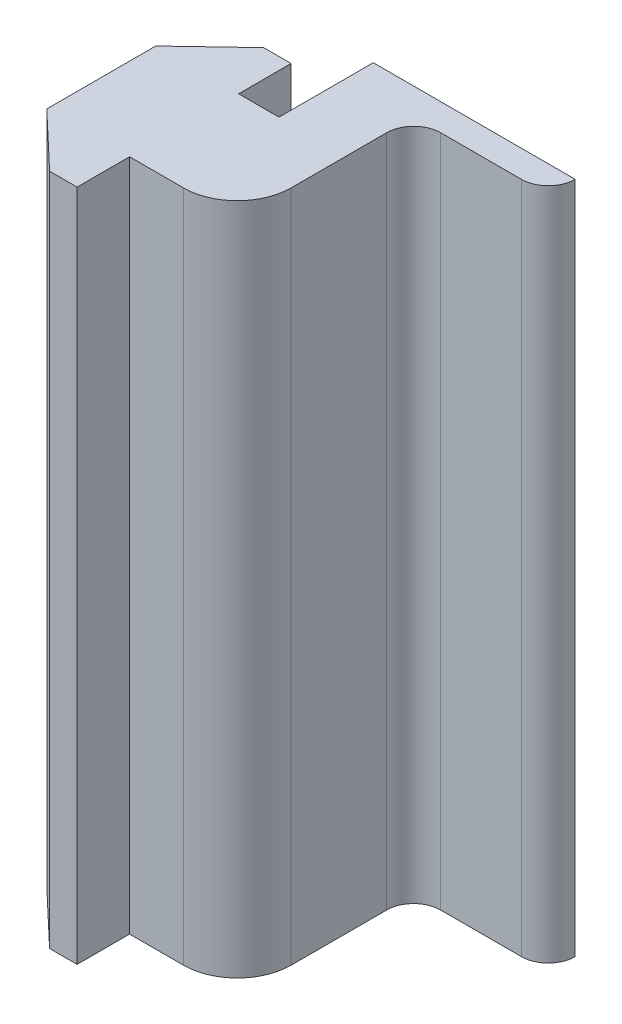
ISO-10303-21;
HEADER;
FILE_DESCRIPTION(('STEP AP214'),'2;1');
FILE_NAME('part.step','',(''),(''),'','','');
FILE_SCHEMA(('AUTOMOTIVE_DESIGN { 1 0 10303 214 1 1 1 1 }'));
ENDSEC;
DATA;
#1=APPLICATION_CONTEXT('core data for automotive mechanical design processes');
#2=APPLICATION_PROTOCOL_DEFINITION('international standard','automotive_design',2000,#1);
#3=PRODUCT_CONTEXT('',#1,'mechanical');
#4=PRODUCT('Part','Part','',(#3));
#5=PRODUCT_RELATED_PRODUCT_CATEGORY('part','',(#4));
#6=PRODUCT_DEFINITION_FORMATION('','',#4);
#7=PRODUCT_DEFINITION_CONTEXT('part definition',#1,'design');
#8=PRODUCT_DEFINITION('design','',#6,#7);
#9=PRODUCT_DEFINITION_SHAPE('','',#8);
#10=(LENGTH_UNIT() NAMED_UNIT(*) SI_UNIT(.MILLI.,.METRE.));
#11=(NAMED_UNIT(*) PLANE_ANGLE_UNIT() SI_UNIT($,.RADIAN.));
#12=(NAMED_UNIT(*) SI_UNIT($,.STERADIAN.) SOLID_ANGLE_UNIT());
#13=UNCERTAINTY_MEASURE_WITH_UNIT(LENGTH_MEASURE(1.E-05),#10,'distance_accuracy_value','');
#14=(GEOMETRIC_REPRESENTATION_CONTEXT(3) GLOBAL_UNCERTAINTY_ASSIGNED_CONTEXT((#13)) GLOBAL_UNIT_ASSIGNED_CONTEXT((#10,
#11,#12)) REPRESENTATION_CONTEXT('',''));
#15=CARTESIAN_POINT('',(0.,0.,0.));
#16=DIRECTION('',(0.,0.,1.));
#17=DIRECTION('',(1.,0.,0.));
#18=AXIS2_PLACEMENT_3D('',#15,#16,#17);
#19=CARTESIAN_POINT('',(0.,50.,-4.05));
#20=DIRECTION('',(0.,0.,-1.));
#21=DIRECTION('',(-1.,0.,0.));
#22=AXIS2_PLACEMENT_3D('',#19,#20,#21);
#23=PLANE('',#22);
#24=DIRECTION('',(1.,0.,0.));
#25=VECTOR('',#24,1.);
#26=CARTESIAN_POINT('',(0.,0.,-4.05));
#27=LINE('',#26,#25);
#28=CARTESIAN_POINT('',(0.,0.,-4.05));
#29=VERTEX_POINT('',#28);
#30=CARTESIAN_POINT('',(2.99999999999996,0.,-4.05));
#31=VERTEX_POINT('',#30);
#32=EDGE_CURVE('E160',#29,#31,#27,.T.);
#33=ORIENTED_EDGE('',*,*,#32,.F.);
#34=DIRECTION('',(0.,-1.,0.));
#35=VECTOR('',#34,1.);
#36=CARTESIAN_POINT('',(0.,50.,-4.05));
#37=LINE('',#36,#35);
#38=CARTESIAN_POINT('',(0.,50.,-4.05));
#39=VERTEX_POINT('',#38);
#40=EDGE_CURVE('E156',#39,#29,#37,.T.);
#41=ORIENTED_EDGE('',*,*,#40,.F.);
#42=DIRECTION('',(1.,0.,0.));
#43=VECTOR('',#42,1.);
#44=CARTESIAN_POINT('',(0.,50.,-4.05));
#45=LINE('',#44,#43);
#46=CARTESIAN_POINT('',(2.99999999999996,50.,-4.05));
#47=VERTEX_POINT('',#46);
#48=EDGE_CURVE('E158',#39,#47,#45,.T.);
#49=ORIENTED_EDGE('',*,*,#48,.T.);
#50=DIRECTION('',(0.,-1.,0.));
#51=VECTOR('',#50,1.);
#52=CARTESIAN_POINT('',(2.99999999999996,50.,-4.05));
#53=LINE('',#52,#51);
#54=EDGE_CURVE('E221',#47,#31,#53,.T.);
#55=ORIENTED_EDGE('',*,*,#54,.T.);
#56=EDGE_LOOP('',(#33,#41,#49,#55));
#57=FACE_BOUND('',#56,.T.);
#58=ADVANCED_FACE('F44',(#57),#23,.T.);
#59=CARTESIAN_POINT('',(0.,50.,0.));
#60=DIRECTION('',(1.,0.,0.));
#61=DIRECTION('',(0.,0.,-1.));
#62=AXIS2_PLACEMENT_3D('',#59,#60,#61);
#63=PLANE('',#62);
#64=DIRECTION('',(0.,0.,1.));
#65=VECTOR('',#64,1.);
#66=CARTESIAN_POINT('',(0.,0.,0.));
#67=LINE('',#66,#65);
#68=CARTESIAN_POINT('',(0.,0.,-7.95));
#69=VERTEX_POINT('',#68);
#70=EDGE_CURVE('E224',#69,#29,#67,.T.);
#71=ORIENTED_EDGE('',*,*,#70,.F.);
#72=DIRECTION('',(0.,-1.,0.));
#73=VECTOR('',#72,1.);
#74=CARTESIAN_POINT('',(0.,50.,-7.95));
#75=LINE('',#74,#73);
#76=CARTESIAN_POINT('',(0.,50.,-7.95));
#77=VERTEX_POINT('',#76);
#78=EDGE_CURVE('E167',#77,#69,#75,.T.);
#79=ORIENTED_EDGE('',*,*,#78,.F.);
#80=DIRECTION('',(0.,0.,1.));
#81=VECTOR('',#80,1.);
#82=CARTESIAN_POINT('',(0.,50.,0.));
#83=LINE('',#82,#81);
#84=EDGE_CURVE('E173',#77,#39,#83,.T.);
#85=ORIENTED_EDGE('',*,*,#84,.T.);
#86=ORIENTED_EDGE('',*,*,#40,.T.);
#87=EDGE_LOOP('',(#71,#79,#85,#86));
#88=FACE_BOUND('',#87,.T.);
#89=ADVANCED_FACE('F181',(#88),#63,.T.);
#90=CARTESIAN_POINT('',(0.,50.,-7.95));
#91=DIRECTION('',(0.,0.,-1.));
#92=DIRECTION('',(-1.,0.,0.));
#93=AXIS2_PLACEMENT_3D('',#90,#91,#92);
#94=PLANE('',#93);
#95=DIRECTION('',(1.,0.,0.));
#96=VECTOR('',#95,1.);
#97=CARTESIAN_POINT('',(0.,0.,-7.95));
#98=LINE('',#97,#96);
#99=CARTESIAN_POINT('',(-2.04000000000008,0.,-7.94999999999998));
#100=VERTEX_POINT('',#99);
#101=EDGE_CURVE('E227',#100,#69,#98,.T.);
#102=ORIENTED_EDGE('',*,*,#101,.F.);
#103=DIRECTION('',(0.,-1.,0.));
#104=VECTOR('',#103,1.);
#105=CARTESIAN_POINT('',(-2.04000000000008,50.,-7.94999999999998));
#106=LINE('',#105,#104);
#107=CARTESIAN_POINT('',(-2.04000000000008,50.,-7.94999999999998));
#108=VERTEX_POINT('',#107);
#109=EDGE_CURVE('E289',#108,#100,#106,.T.);
#110=ORIENTED_EDGE('',*,*,#109,.F.);
#111=DIRECTION('',(1.,0.,0.));
#112=VECTOR('',#111,1.);
#113=CARTESIAN_POINT('',(0.,50.,-7.95));
#114=LINE('',#113,#112);
#115=EDGE_CURVE('E183',#108,#77,#114,.T.);
#116=ORIENTED_EDGE('',*,*,#115,.T.);
#117=ORIENTED_EDGE('',*,*,#78,.T.);
#118=EDGE_LOOP('',(#102,#110,#116,#117));
#119=FACE_BOUND('',#118,.T.);
#120=ADVANCED_FACE('F362',(#119),#94,.T.);
#121=CARTESIAN_POINT('',(-4.93600140143802,50.,-5.20217481392659));
#122=DIRECTION('',(-0.688304815664146,0.,-0.725421588273706));
#123=DIRECTION('',(-0.725421588273706,0.,0.688304815664146));
#124=AXIS2_PLACEMENT_3D('',#121,#122,#123);
#125=PLANE('',#124);
#126=DIRECTION('',(0.725421588273706,0.,-0.688304815664146));
#127=VECTOR('',#126,1.);
#128=CARTESIAN_POINT('',(-4.93600140143802,0.,-5.20217481392659));
#129=LINE('',#128,#127);
#130=CARTESIAN_POINT('',(-6.15241498392372,0.,-4.04799999999993));
#131=VERTEX_POINT('',#130);
#132=EDGE_CURVE('E232',#131,#100,#129,.T.);
#133=ORIENTED_EDGE('',*,*,#132,.F.);
#134=DIRECTION('',(0.,-1.,0.));
#135=VECTOR('',#134,1.);
#136=CARTESIAN_POINT('',(-6.15241498392372,50.,-4.04799999999993));
#137=LINE('',#136,#135);
#138=CARTESIAN_POINT('',(-6.15241498392372,50.,-4.04799999999993));
#139=VERTEX_POINT('',#138);
#140=EDGE_CURVE('E286',#139,#131,#137,.T.);
#141=ORIENTED_EDGE('',*,*,#140,.F.);
#142=DIRECTION('',(0.725421588273706,0.,-0.688304815664146));
#143=VECTOR('',#142,1.);
#144=CARTESIAN_POINT('',(-4.93600140143802,50.,-5.20217481392659));
#145=LINE('',#144,#143);
#146=EDGE_CURVE('E187',#139,#108,#145,.T.);
#147=ORIENTED_EDGE('',*,*,#146,.T.);
#148=ORIENTED_EDGE('',*,*,#109,.T.);
#149=EDGE_LOOP('',(#133,#141,#147,#148));
#150=FACE_BOUND('',#149,.T.);
#151=ADVANCED_FACE('F358',(#150),#125,.T.);
#152=CARTESIAN_POINT('',(-6.15241498392368,50.,0.));
#153=DIRECTION('',(-1.,0.,0.));
#154=DIRECTION('',(0.,0.,1.));
#155=AXIS2_PLACEMENT_3D('',#152,#153,#154);
#156=PLANE('',#155);
#157=DIRECTION('',(0.,0.,-1.));
#158=VECTOR('',#157,1.);
#159=CARTESIAN_POINT('',(-6.15241498392368,0.,0.));
#160=LINE('',#159,#158);
#161=CARTESIAN_POINT('',(-6.15241498392364,0.,4.04800000000007));
#162=VERTEX_POINT('',#161);
#163=EDGE_CURVE('E236',#162,#131,#160,.T.);
#164=ORIENTED_EDGE('',*,*,#163,.F.);
#165=DIRECTION('',(0.,-1.,0.));
#166=VECTOR('',#165,1.);
#167=CARTESIAN_POINT('',(-6.15241498392364,50.,4.04800000000007));
#168=LINE('',#167,#166);
#169=CARTESIAN_POINT('',(-6.15241498392364,50.,4.04800000000007));
#170=VERTEX_POINT('',#169);
#171=EDGE_CURVE('E283',#170,#162,#168,.T.);
#172=ORIENTED_EDGE('',*,*,#171,.F.);
#173=DIRECTION('',(0.,0.,-1.));
#174=VECTOR('',#173,1.);
#175=CARTESIAN_POINT('',(-6.15241498392368,50.,0.));
#176=LINE('',#175,#174);
#177=EDGE_CURVE('E207',#170,#139,#176,.T.);
#178=ORIENTED_EDGE('',*,*,#177,.T.);
#179=ORIENTED_EDGE('',*,*,#140,.T.);
#180=EDGE_LOOP('',(#164,#172,#178,#179));
#181=FACE_BOUND('',#180,.T.);
#182=ADVANCED_FACE('F354',(#181),#156,.T.);
#183=CARTESIAN_POINT('',(-4.93600140143791,50.,5.2021748139267));
#184=DIRECTION('',(-0.68830481566413,0.,0.725421588273721));
#185=DIRECTION('',(0.725421588273721,0.,0.68830481566413));
#186=AXIS2_PLACEMENT_3D('',#183,#184,#185);
#187=PLANE('',#186);
#188=DIRECTION('',(-0.725421588273721,0.,-0.68830481566413));
#189=VECTOR('',#188,1.);
#190=CARTESIAN_POINT('',(-4.93600140143791,0.,5.2021748139267));
#191=LINE('',#190,#189);
#192=CARTESIAN_POINT('',(-2.03999999999991,0.,7.95000000000002));
#193=VERTEX_POINT('',#192);
#194=EDGE_CURVE('E240',#193,#162,#191,.T.);
#195=ORIENTED_EDGE('',*,*,#194,.F.);
#196=DIRECTION('',(0.,-1.,0.));
#197=VECTOR('',#196,1.);
#198=CARTESIAN_POINT('',(-2.03999999999991,50.,7.95000000000002));
#199=LINE('',#198,#197);
#200=CARTESIAN_POINT('',(-2.03999999999991,50.,7.95000000000002));
#201=VERTEX_POINT('',#200);
#202=EDGE_CURVE('E280',#201,#193,#199,.T.);
#203=ORIENTED_EDGE('',*,*,#202,.F.);
#204=DIRECTION('',(-0.725421588273721,0.,-0.68830481566413));
#205=VECTOR('',#204,1.);
#206=CARTESIAN_POINT('',(-4.93600140143791,50.,5.2021748139267));
#207=LINE('',#206,#205);
#208=EDGE_CURVE('E201',#201,#170,#207,.T.);
#209=ORIENTED_EDGE('',*,*,#208,.T.);
#210=ORIENTED_EDGE('',*,*,#171,.T.);
#211=EDGE_LOOP('',(#195,#203,#209,#210));
#212=FACE_BOUND('',#211,.T.);
#213=ADVANCED_FACE('F349',(#212),#187,.T.);
#214=CARTESIAN_POINT('',(0.,50.,7.95));
#215=DIRECTION('',(0.,0.,1.));
#216=DIRECTION('',(1.,0.,0.));
#217=AXIS2_PLACEMENT_3D('',#214,#215,#216);
#218=PLANE('',#217);
#219=DIRECTION('',(-1.,0.,0.));
#220=VECTOR('',#219,1.);
#221=CARTESIAN_POINT('',(0.,0.,7.95));
#222=LINE('',#221,#220);
#223=CARTESIAN_POINT('',(0.,0.,7.95));
#224=VERTEX_POINT('',#223);
#225=EDGE_CURVE('E244',#224,#193,#222,.T.);
#226=ORIENTED_EDGE('',*,*,#225,.F.);
#227=DIRECTION('',(0.,-1.,0.));
#228=VECTOR('',#227,1.);
#229=CARTESIAN_POINT('',(0.,50.,7.95));
#230=LINE('',#229,#228);
#231=CARTESIAN_POINT('',(0.,50.,7.95));
#232=VERTEX_POINT('',#231);
#233=EDGE_CURVE('E277',#232,#224,#230,.T.);
#234=ORIENTED_EDGE('',*,*,#233,.F.);
#235=DIRECTION('',(-1.,0.,0.));
#236=VECTOR('',#235,1.);
#237=CARTESIAN_POINT('',(0.,50.,7.95));
#238=LINE('',#237,#236);
#239=EDGE_CURVE('E192',#232,#201,#238,.T.);
#240=ORIENTED_EDGE('',*,*,#239,.T.);
#241=ORIENTED_EDGE('',*,*,#202,.T.);
#242=EDGE_LOOP('',(#226,#234,#240,#241));
#243=FACE_BOUND('',#242,.T.);
#244=ADVANCED_FACE('F346',(#243),#218,.T.);
#245=CARTESIAN_POINT('',(0.,0.,4.05));
#246=VERTEX_POINT('',#245);
#247=EDGE_CURVE('E228',#246,#224,#67,.T.);
#248=ORIENTED_EDGE('',*,*,#247,.F.);
#249=DIRECTION('',(0.,-1.,0.));
#250=VECTOR('',#249,1.);
#251=CARTESIAN_POINT('',(0.,50.,4.05));
#252=LINE('',#251,#250);
#253=CARTESIAN_POINT('',(0.,50.,4.05));
#254=VERTEX_POINT('',#253);
#255=EDGE_CURVE('E274',#254,#246,#252,.T.);
#256=ORIENTED_EDGE('',*,*,#255,.F.);
#257=EDGE_CURVE('E185',#254,#232,#83,.T.);
#258=ORIENTED_EDGE('',*,*,#257,.T.);
#259=ORIENTED_EDGE('',*,*,#233,.T.);
#260=EDGE_LOOP('',(#248,#256,#258,#259));
#261=FACE_BOUND('',#260,.T.);
#262=ADVANCED_FACE('F342',(#261),#63,.T.);
#263=CARTESIAN_POINT('',(0.,50.,4.05));
#264=DIRECTION('',(0.,0.,-1.));
#265=DIRECTION('',(-1.,0.,0.));
#266=AXIS2_PLACEMENT_3D('',#263,#264,#265);
#267=PLANE('',#266);
#268=DIRECTION('',(1.,0.,0.));
#269=VECTOR('',#268,1.);
#270=CARTESIAN_POINT('',(0.,0.,4.05));
#271=LINE('',#270,#269);
#272=CARTESIAN_POINT('',(3.99999999999996,0.,4.05));
#273=VERTEX_POINT('',#272);
#274=EDGE_CURVE('E248',#246,#273,#271,.T.);
#275=ORIENTED_EDGE('',*,*,#274,.T.);
#276=DIRECTION('',(0.,-1.,0.));
#277=VECTOR('',#276,1.);
#278=CARTESIAN_POINT('',(3.99999999999996,50.,4.05));
#279=LINE('',#278,#277);
#280=CARTESIAN_POINT('',(3.99999999999996,50.,4.05));
#281=VERTEX_POINT('',#280);
#282=EDGE_CURVE('E316',#273,#281,#279,.F.);
#283=ORIENTED_EDGE('',*,*,#282,.T.);
#284=DIRECTION('',(1.,0.,0.));
#285=VECTOR('',#284,1.);
#286=CARTESIAN_POINT('',(0.,50.,4.05));
#287=LINE('',#286,#285);
#288=EDGE_CURVE('E191',#254,#281,#287,.T.);
#289=ORIENTED_EDGE('',*,*,#288,.F.);
#290=ORIENTED_EDGE('',*,*,#255,.T.);
#291=EDGE_LOOP('',(#275,#283,#289,#290));
#292=FACE_BOUND('',#291,.T.);
#293=ADVANCED_FACE('F341',(#292),#267,.F.);
#294=CARTESIAN_POINT('',(7.99999999999996,50.,0.));
#295=DIRECTION('',(-1.,0.,0.));
#296=DIRECTION('',(0.,0.,1.));
#297=AXIS2_PLACEMENT_3D('',#294,#295,#296);
#298=PLANE('',#297);
#299=DIRECTION('',(0.,0.,-1.));
#300=VECTOR('',#299,1.);
#301=CARTESIAN_POINT('',(7.99999999999996,50.,0.));
#302=LINE('',#301,#300);
#303=CARTESIAN_POINT('',(7.99999999999996,50.,0.0499999999999997));
#304=VERTEX_POINT('',#303);
#305=CARTESIAN_POINT('',(7.99999999999996,50.,-7.05));
#306=VERTEX_POINT('',#305);
#307=EDGE_CURVE('E198',#304,#306,#302,.T.);
#308=ORIENTED_EDGE('',*,*,#307,.F.);
#309=DIRECTION('',(0.,-1.,0.));
#310=VECTOR('',#309,1.);
#311=CARTESIAN_POINT('',(7.99999999999996,50.,0.0499999999999997));
#312=LINE('',#311,#310);
#313=CARTESIAN_POINT('',(7.99999999999996,0.,0.0499999999999997));
#314=VERTEX_POINT('',#313);
#315=EDGE_CURVE('E309',#304,#314,#312,.T.);
#316=ORIENTED_EDGE('',*,*,#315,.T.);
#317=DIRECTION('',(0.,0.,-1.));
#318=VECTOR('',#317,1.);
#319=CARTESIAN_POINT('',(7.99999999999996,0.,0.));
#320=LINE('',#319,#318);
#321=CARTESIAN_POINT('',(7.99999999999996,0.,-7.05));
#322=VERTEX_POINT('',#321);
#323=EDGE_CURVE('E252',#314,#322,#320,.T.);
#324=ORIENTED_EDGE('',*,*,#323,.T.);
#325=DIRECTION('',(0.,-1.,0.));
#326=VECTOR('',#325,1.);
#327=CARTESIAN_POINT('',(7.99999999999996,50.,-7.05));
#328=LINE('',#327,#326);
#329=EDGE_CURVE('E297',#322,#306,#328,.F.);
#330=ORIENTED_EDGE('',*,*,#329,.T.);
#331=EDGE_LOOP('',(#308,#316,#324,#330));
#332=FACE_BOUND('',#331,.T.);
#333=ADVANCED_FACE('F331',(#332),#298,.F.);
#334=CARTESIAN_POINT('',(0.,50.,-9.05));
#335=DIRECTION('',(0.,0.,1.));
#336=DIRECTION('',(1.,0.,0.));
#337=AXIS2_PLACEMENT_3D('',#334,#335,#336);
#338=PLANE('',#337);
#339=DIRECTION('',(-1.,0.,0.));
#340=VECTOR('',#339,1.);
#341=CARTESIAN_POINT('',(0.,0.,-9.05));
#342=LINE('',#341,#340);
#343=CARTESIAN_POINT('',(16.,0.,-9.05));
#344=VERTEX_POINT('',#343);
#345=CARTESIAN_POINT('',(9.99999999999996,0.,-9.05));
#346=VERTEX_POINT('',#345);
#347=EDGE_CURVE('E255',#344,#346,#342,.T.);
#348=ORIENTED_EDGE('',*,*,#347,.F.);
#349=DIRECTION('',(0.,-1.,0.));
#350=VECTOR('',#349,1.);
#351=CARTESIAN_POINT('',(16.,50.,-9.05));
#352=LINE('',#351,#350);
#353=CARTESIAN_POINT('',(16.,50.,-9.05));
#354=VERTEX_POINT('',#353);
#355=EDGE_CURVE('E53',#344,#354,#352,.F.);
#356=ORIENTED_EDGE('',*,*,#355,.T.);
#357=DIRECTION('',(-1.,0.,0.));
#358=VECTOR('',#357,1.);
#359=CARTESIAN_POINT('',(0.,50.,-9.05));
#360=LINE('',#359,#358);
#361=CARTESIAN_POINT('',(9.99999999999996,50.,-9.05));
#362=VERTEX_POINT('',#361);
#363=EDGE_CURVE('E213',#354,#362,#360,.T.);
#364=ORIENTED_EDGE('',*,*,#363,.T.);
#365=DIRECTION('',(0.,-1.,0.));
#366=VECTOR('',#365,1.);
#367=CARTESIAN_POINT('',(9.99999999999996,50.,-9.05));
#368=LINE('',#367,#366);
#369=EDGE_CURVE('E166',#362,#346,#368,.T.);
#370=ORIENTED_EDGE('',*,*,#369,.T.);
#371=EDGE_LOOP('',(#348,#356,#364,#370));
#372=FACE_BOUND('',#371,.T.);
#373=ADVANCED_FACE('F374',(#372),#338,.T.);
#374=CARTESIAN_POINT('',(0.,50.,-11.05));
#375=DIRECTION('',(0.,0.,1.));
#376=DIRECTION('',(1.,0.,0.));
#377=AXIS2_PLACEMENT_3D('',#374,#375,#376);
#378=PLANE('',#377);
#379=DIRECTION('',(-1.,0.,0.));
#380=VECTOR('',#379,1.);
#381=CARTESIAN_POINT('',(0.,0.,-11.05));
#382=LINE('',#381,#380);
#383=CARTESIAN_POINT('',(18.,0.,-11.05));
#384=VERTEX_POINT('',#383);
#385=CARTESIAN_POINT('',(2.99999999999996,0.,-11.05));
#386=VERTEX_POINT('',#385);
#387=EDGE_CURVE('E258',#384,#386,#382,.T.);
#388=ORIENTED_EDGE('',*,*,#387,.T.);
#389=DIRECTION('',(0.,-1.,0.));
#390=VECTOR('',#389,1.);
#391=CARTESIAN_POINT('',(2.99999999999996,50.,-11.05));
#392=LINE('',#391,#390);
#393=CARTESIAN_POINT('',(2.99999999999996,50.,-11.05));
#394=VERTEX_POINT('',#393);
#395=EDGE_CURVE('E266',#394,#386,#392,.T.);
#396=ORIENTED_EDGE('',*,*,#395,.F.);
#397=DIRECTION('',(-1.,0.,0.));
#398=VECTOR('',#397,1.);
#399=CARTESIAN_POINT('',(0.,50.,-11.05));
#400=LINE('',#399,#398);
#401=CARTESIAN_POINT('',(18.,50.,-11.05));
#402=VERTEX_POINT('',#401);
#403=EDGE_CURVE('E216',#402,#394,#400,.T.);
#404=ORIENTED_EDGE('',*,*,#403,.F.);
#405=DIRECTION('',(0.,-1.,0.));
#406=VECTOR('',#405,1.);
#407=CARTESIAN_POINT('',(18.,50.,-11.05));
#408=LINE('',#407,#406);
#409=EDGE_CURVE('E270',#402,#384,#408,.T.);
#410=ORIENTED_EDGE('',*,*,#409,.T.);
#411=EDGE_LOOP('',(#388,#396,#404,#410));
#412=FACE_BOUND('',#411,.T.);
#413=ADVANCED_FACE('F369',(#412),#378,.F.);
#414=CARTESIAN_POINT('',(2.99999999999996,50.,0.));
#415=DIRECTION('',(1.,0.,0.));
#416=DIRECTION('',(0.,0.,-1.));
#417=AXIS2_PLACEMENT_3D('',#414,#415,#416);
#418=PLANE('',#417);
#419=DIRECTION('',(0.,0.,1.));
#420=VECTOR('',#419,1.);
#421=CARTESIAN_POINT('',(2.99999999999996,0.,0.));
#422=LINE('',#421,#420);
#423=EDGE_CURVE('E179',#386,#31,#422,.T.);
#424=ORIENTED_EDGE('',*,*,#423,.T.);
#425=ORIENTED_EDGE('',*,*,#54,.F.);
#426=DIRECTION('',(0.,0.,1.));
#427=VECTOR('',#426,1.);
#428=CARTESIAN_POINT('',(2.99999999999996,50.,0.));
#429=LINE('',#428,#427);
#430=EDGE_CURVE('E176',#394,#47,#429,.T.);
#431=ORIENTED_EDGE('',*,*,#430,.F.);
#432=ORIENTED_EDGE('',*,*,#395,.T.);
#433=EDGE_LOOP('',(#424,#425,#431,#432));
#434=FACE_BOUND('',#433,.T.);
#435=ADVANCED_FACE('F365',(#434),#418,.F.);
#436=CARTESIAN_POINT('',(0.,50.,0.));
#437=DIRECTION('',(0.,1.,0.));
#438=DIRECTION('',(0.,0.,1.));
#439=AXIS2_PLACEMENT_3D('',#436,#437,#438);
#440=PLANE('',#439);
#441=ORIENTED_EDGE('',*,*,#363,.F.);
#442=CARTESIAN_POINT('',(16.,50.,-11.05));
#443=DIRECTION('',(0.,1.,0.));
#444=DIRECTION('',(0.,0.,1.));
#445=AXIS2_PLACEMENT_3D('',#442,#443,#444);
#446=CIRCLE('',#445,2.);
#447=EDGE_CURVE('E11',#354,#402,#446,.T.);
#448=ORIENTED_EDGE('',*,*,#447,.T.);
#449=ORIENTED_EDGE('',*,*,#403,.T.);
#450=ORIENTED_EDGE('',*,*,#430,.T.);
#451=ORIENTED_EDGE('',*,*,#48,.F.);
#452=ORIENTED_EDGE('',*,*,#84,.F.);
#453=ORIENTED_EDGE('',*,*,#115,.F.);
#454=ORIENTED_EDGE('',*,*,#146,.F.);
#455=ORIENTED_EDGE('',*,*,#177,.F.);
#456=ORIENTED_EDGE('',*,*,#208,.F.);
#457=ORIENTED_EDGE('',*,*,#239,.F.);
#458=ORIENTED_EDGE('',*,*,#257,.F.);
#459=ORIENTED_EDGE('',*,*,#288,.T.);
#460=CARTESIAN_POINT('',(3.99999999999996,50.,0.0499999999999997));
#461=DIRECTION('',(0.,1.,0.));
#462=DIRECTION('',(0.,0.,1.));
#463=AXIS2_PLACEMENT_3D('',#460,#461,#462);
#464=CIRCLE('',#463,4.);
#465=EDGE_CURVE('E319',#281,#304,#464,.T.);
#466=ORIENTED_EDGE('',*,*,#465,.T.);
#467=ORIENTED_EDGE('',*,*,#307,.T.);
#468=CARTESIAN_POINT('',(9.99999999999996,50.,-7.05));
#469=DIRECTION('',(0.,1.,0.));
#470=DIRECTION('',(0.,0.,1.));
#471=AXIS2_PLACEMENT_3D('',#468,#469,#470);
#472=CIRCLE('',#471,2.);
#473=EDGE_CURVE('E305',#306,#362,#472,.F.);
#474=ORIENTED_EDGE('',*,*,#473,.T.);
#475=EDGE_LOOP('',(#441,#448,#449,#450,#451,#452,#453,#454,#455,#456,#457,#458,#459,#466,#467,#474));
#476=FACE_BOUND('',#475,.T.);
#477=ADVANCED_FACE('F171',(#476),#440,.T.);
#478=CARTESIAN_POINT('',(0.,0.,0.));
#479=DIRECTION('',(0.,1.,0.));
#480=DIRECTION('',(0.,0.,1.));
#481=AXIS2_PLACEMENT_3D('',#478,#479,#480);
#482=PLANE('',#481);
#483=ORIENTED_EDGE('',*,*,#387,.F.);
#484=CARTESIAN_POINT('',(16.,0.,-11.05));
#485=DIRECTION('',(0.,1.,0.));
#486=DIRECTION('',(0.,0.,1.));
#487=AXIS2_PLACEMENT_3D('',#484,#485,#486);
#488=CIRCLE('',#487,2.);
#489=EDGE_CURVE('E67',#384,#344,#488,.F.);
#490=ORIENTED_EDGE('',*,*,#489,.T.);
#491=ORIENTED_EDGE('',*,*,#347,.T.);
#492=CARTESIAN_POINT('',(9.99999999999996,0.,-7.05));
#493=DIRECTION('',(0.,1.,0.));
#494=DIRECTION('',(0.,0.,1.));
#495=AXIS2_PLACEMENT_3D('',#492,#493,#494);
#496=CIRCLE('',#495,2.);
#497=EDGE_CURVE('E301',#346,#322,#496,.T.);
#498=ORIENTED_EDGE('',*,*,#497,.T.);
#499=ORIENTED_EDGE('',*,*,#323,.F.);
#500=CARTESIAN_POINT('',(3.99999999999996,0.,0.0499999999999997));
#501=DIRECTION('',(0.,1.,0.));
#502=DIRECTION('',(0.,0.,1.));
#503=AXIS2_PLACEMENT_3D('',#500,#501,#502);
#504=CIRCLE('',#503,4.);
#505=EDGE_CURVE('E313',#314,#273,#504,.F.);
#506=ORIENTED_EDGE('',*,*,#505,.T.);
#507=ORIENTED_EDGE('',*,*,#274,.F.);
#508=ORIENTED_EDGE('',*,*,#247,.T.);
#509=ORIENTED_EDGE('',*,*,#225,.T.);
#510=ORIENTED_EDGE('',*,*,#194,.T.);
#511=ORIENTED_EDGE('',*,*,#163,.T.);
#512=ORIENTED_EDGE('',*,*,#132,.T.);
#513=ORIENTED_EDGE('',*,*,#101,.T.);
#514=ORIENTED_EDGE('',*,*,#70,.T.);
#515=ORIENTED_EDGE('',*,*,#32,.T.);
#516=ORIENTED_EDGE('',*,*,#423,.F.);
#517=EDGE_LOOP('',(#483,#490,#491,#498,#499,#506,#507,#508,#509,#510,#511,#512,#513,#514,#515,#516));
#518=FACE_BOUND('',#517,.T.);
#519=ADVANCED_FACE('F337',(#518),#482,.F.);
#520=CARTESIAN_POINT('',(9.99999999999996,50.,-7.05));
#521=DIRECTION('',(0.,-1.,0.));
#522=DIRECTION('',(0.,0.,-1.));
#523=AXIS2_PLACEMENT_3D('',#520,#521,#522);
#524=CYLINDRICAL_SURFACE('',#523,2.);
#525=ORIENTED_EDGE('',*,*,#473,.F.);
#526=ORIENTED_EDGE('',*,*,#329,.F.);
#527=ORIENTED_EDGE('',*,*,#497,.F.);
#528=ORIENTED_EDGE('',*,*,#369,.F.);
#529=EDGE_LOOP('',(#525,#526,#527,#528));
#530=FACE_BOUND('',#529,.T.);
#531=ADVANCED_FACE('F377',(#530),#524,.F.);
#532=CARTESIAN_POINT('',(3.99999999999996,50.,0.0499999999999997));
#533=DIRECTION('',(0.,-1.,0.));
#534=DIRECTION('',(0.,0.,-1.));
#535=AXIS2_PLACEMENT_3D('',#532,#533,#534);
#536=CYLINDRICAL_SURFACE('',#535,4.);
#537=ORIENTED_EDGE('',*,*,#465,.F.);
#538=ORIENTED_EDGE('',*,*,#282,.F.);
#539=ORIENTED_EDGE('',*,*,#505,.F.);
#540=ORIENTED_EDGE('',*,*,#315,.F.);
#541=EDGE_LOOP('',(#537,#538,#539,#540));
#542=FACE_BOUND('',#541,.T.);
#543=ADVANCED_FACE('F335',(#542),#536,.T.);
#544=CARTESIAN_POINT('',(16.,50.,-11.05));
#545=DIRECTION('',(0.,-1.,0.));
#546=DIRECTION('',(0.,0.,-1.));
#547=AXIS2_PLACEMENT_3D('',#544,#545,#546);
#548=CYLINDRICAL_SURFACE('',#547,2.);
#549=ORIENTED_EDGE('',*,*,#447,.F.);
#550=ORIENTED_EDGE('',*,*,#355,.F.);
#551=ORIENTED_EDGE('',*,*,#489,.F.);
#552=ORIENTED_EDGE('',*,*,#409,.F.);
#553=EDGE_LOOP('',(#549,#550,#551,#552));
#554=FACE_BOUND('',#553,.T.);
#555=ADVANCED_FACE('F46',(#554),#548,.T.);
#556=CLOSED_SHELL('',(#58,#89,#120,#151,#182,#213,#244,#262,#293,#333,#373,#413,#435,#477,#519,
#531,#543,#555));
#557=MANIFOLD_SOLID_BREP('B2',#556);
#558=ADVANCED_BREP_SHAPE_REPRESENTATION('',(#18,#557),#14);
#559=SHAPE_DEFINITION_REPRESENTATION(#9,#558);
ENDSEC;
END-ISO-10303-21;
